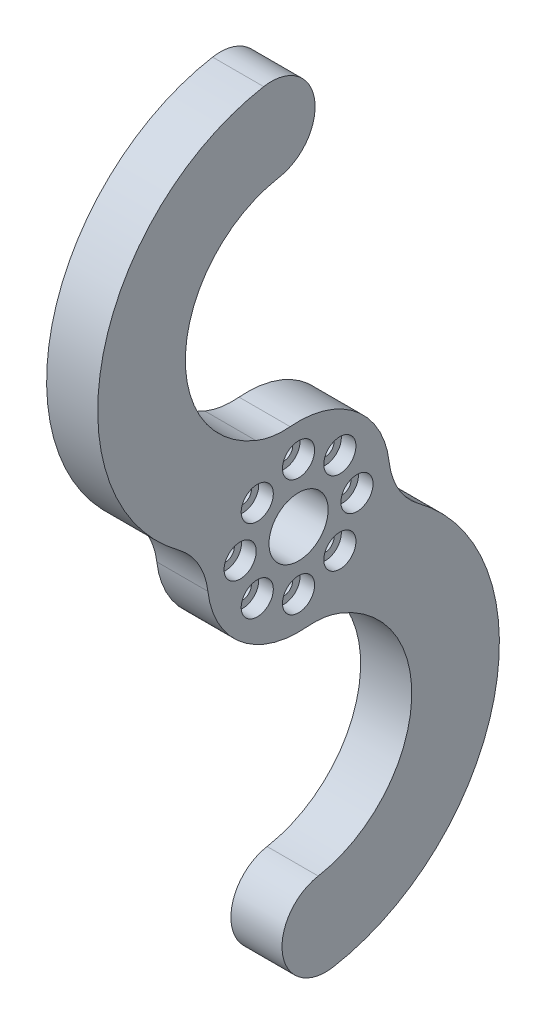
ISO-10303-21;
HEADER;
FILE_DESCRIPTION(('STEP AP214'),'2;1');
FILE_NAME('part.step','',(''),(''),'','','');
FILE_SCHEMA(('AUTOMOTIVE_DESIGN { 1 0 10303 214 1 1 1 1 }'));
ENDSEC;
DATA;
#1=APPLICATION_CONTEXT('core data for automotive mechanical design processes');
#2=APPLICATION_PROTOCOL_DEFINITION('international standard','automotive_design',2000,#1);
#3=PRODUCT_CONTEXT('',#1,'mechanical');
#4=PRODUCT('Part','Part','',(#3));
#5=PRODUCT_RELATED_PRODUCT_CATEGORY('part','',(#4));
#6=PRODUCT_DEFINITION_FORMATION('','',#4);
#7=PRODUCT_DEFINITION_CONTEXT('part definition',#1,'design');
#8=PRODUCT_DEFINITION('design','',#6,#7);
#9=PRODUCT_DEFINITION_SHAPE('','',#8);
#10=(LENGTH_UNIT() NAMED_UNIT(*) SI_UNIT(.MILLI.,.METRE.));
#11=(NAMED_UNIT(*) PLANE_ANGLE_UNIT() SI_UNIT($,.RADIAN.));
#12=(NAMED_UNIT(*) SI_UNIT($,.STERADIAN.) SOLID_ANGLE_UNIT());
#13=UNCERTAINTY_MEASURE_WITH_UNIT(LENGTH_MEASURE(1.E-05),#10,'distance_accuracy_value','');
#14=(GEOMETRIC_REPRESENTATION_CONTEXT(3) GLOBAL_UNCERTAINTY_ASSIGNED_CONTEXT((#13)) GLOBAL_UNIT_ASSIGNED_CONTEXT((#10,
#11,#12)) REPRESENTATION_CONTEXT('',''));
#15=CARTESIAN_POINT('',(0.,0.,0.));
#16=DIRECTION('',(0.,0.,1.));
#17=DIRECTION('',(1.,0.,0.));
#18=AXIS2_PLACEMENT_3D('',#15,#16,#17);
#19=CARTESIAN_POINT('',(7.,0.,0.));
#20=DIRECTION('',(-1.,0.,0.));
#21=DIRECTION('',(0.,0.,1.));
#22=AXIS2_PLACEMENT_3D('',#19,#20,#21);
#23=CYLINDRICAL_SURFACE('',#22,12.5);
#24=CARTESIAN_POINT('',(0.,0.,0.));
#25=DIRECTION('',(1.,0.,0.));
#26=DIRECTION('',(0.,0.,-1.));
#27=AXIS2_PLACEMENT_3D('',#24,#25,#26);
#28=CIRCLE('',#27,12.5);
#29=CARTESIAN_POINT('',(0.,1.45202020202021,-12.4153790652128));
#30=VERTEX_POINT('',#29);
#31=CARTESIAN_POINT('',(0.,12.4469696969697,1.150193619665));
#32=VERTEX_POINT('',#31);
#33=EDGE_CURVE('E185',#30,#32,#28,.T.);
#34=ORIENTED_EDGE('',*,*,#33,.T.);
#35=DIRECTION('',(-1.,0.,0.));
#36=VECTOR('',#35,1.);
#37=CARTESIAN_POINT('',(7.,12.4469696969697,1.150193619665));
#38=LINE('',#37,#36);
#39=CARTESIAN_POINT('',(7.,12.4469696969697,1.150193619665));
#40=VERTEX_POINT('',#39);
#41=EDGE_CURVE('E235',#32,#40,#38,.F.);
#42=ORIENTED_EDGE('',*,*,#41,.T.);
#43=CARTESIAN_POINT('',(7.,0.,0.));
#44=DIRECTION('',(1.,0.,0.));
#45=DIRECTION('',(0.,0.,-1.));
#46=AXIS2_PLACEMENT_3D('',#43,#44,#45);
#47=CIRCLE('',#46,12.5);
#48=CARTESIAN_POINT('',(7.,1.45202020202021,-12.4153790652128));
#49=VERTEX_POINT('',#48);
#50=EDGE_CURVE('E161',#49,#40,#47,.T.);
#51=ORIENTED_EDGE('',*,*,#50,.F.);
#52=DIRECTION('',(-1.,0.,0.));
#53=VECTOR('',#52,1.);
#54=CARTESIAN_POINT('',(7.,1.45202020202021,-12.4153790652128));
#55=LINE('',#54,#53);
#56=EDGE_CURVE('E231',#49,#30,#55,.T.);
#57=ORIENTED_EDGE('',*,*,#56,.T.);
#58=EDGE_LOOP('',(#34,#42,#51,#57));
#59=FACE_BOUND('',#58,.T.);
#60=ADVANCED_FACE('F41',(#59),#23,.T.);
#61=CARTESIAN_POINT('',(7.,27.5,0.));
#62=DIRECTION('',(-1.,0.,0.));
#63=DIRECTION('',(0.,0.,1.));
#64=AXIS2_PLACEMENT_3D('',#61,#62,#63);
#65=CYLINDRICAL_SURFACE('',#64,15.5);
#66=CARTESIAN_POINT('',(7.,27.5,0.));
#67=DIRECTION('',(1.,0.,0.));
#68=DIRECTION('',(0.,0.,-1.));
#69=AXIS2_PLACEMENT_3D('',#66,#67,#68);
#70=CIRCLE('',#69,15.5);
#71=CARTESIAN_POINT('',(7.,42.7645201716892,2.69154675383743));
#72=VERTEX_POINT('',#71);
#73=CARTESIAN_POINT('',(7.,13.1400826446281,5.83461854339158));
#74=VERTEX_POINT('',#73);
#75=EDGE_CURVE('E136',#72,#74,#70,.T.);
#76=ORIENTED_EDGE('',*,*,#75,.T.);
#77=DIRECTION('',(-1.,0.,0.));
#78=VECTOR('',#77,1.);
#79=CARTESIAN_POINT('',(7.,13.1400826446281,5.83461854339158));
#80=LINE('',#79,#78);
#81=CARTESIAN_POINT('',(0.,13.1400826446281,5.83461854339158));
#82=VERTEX_POINT('',#81);
#83=EDGE_CURVE('E228',#74,#82,#80,.T.);
#84=ORIENTED_EDGE('',*,*,#83,.T.);
#85=CARTESIAN_POINT('',(0.,27.5,0.));
#86=DIRECTION('',(1.,0.,0.));
#87=DIRECTION('',(0.,0.,-1.));
#88=AXIS2_PLACEMENT_3D('',#85,#86,#87);
#89=CIRCLE('',#88,15.5);
#90=CARTESIAN_POINT('',(0.,42.7645201716892,2.69154675383743));
#91=VERTEX_POINT('',#90);
#92=EDGE_CURVE('E139',#91,#82,#89,.T.);
#93=ORIENTED_EDGE('',*,*,#92,.F.);
#94=DIRECTION('',(-1.,0.,0.));
#95=VECTOR('',#94,1.);
#96=CARTESIAN_POINT('',(7.,42.7645201716892,2.69154675383743));
#97=LINE('',#96,#95);
#98=EDGE_CURVE('E131',#72,#91,#97,.T.);
#99=ORIENTED_EDGE('',*,*,#98,.F.);
#100=EDGE_LOOP('',(#76,#84,#93,#99));
#101=FACE_BOUND('',#100,.T.);
#102=ADVANCED_FACE('F133',(#101),#65,.F.);
#103=CARTESIAN_POINT('',(7.,48.6733666897625,3.73343581983902));
#104=DIRECTION('',(-1.,0.,0.));
#105=DIRECTION('',(0.,0.,1.));
#106=AXIS2_PLACEMENT_3D('',#103,#104,#105);
#107=CYLINDRICAL_SURFACE('',#106,6.00000000000001);
#108=CARTESIAN_POINT('',(0.,48.6733666897625,3.73343581983902));
#109=DIRECTION('',(1.,0.,0.));
#110=DIRECTION('',(0.,0.,-1.));
#111=AXIS2_PLACEMENT_3D('',#108,#109,#110);
#112=CIRCLE('',#111,6.00000000000001);
#113=CARTESIAN_POINT('',(0.,54.5822132078357,4.77532488584061));
#114=VERTEX_POINT('',#113);
#115=EDGE_CURVE('E193',#91,#114,#112,.T.);
#116=ORIENTED_EDGE('',*,*,#115,.T.);
#117=DIRECTION('',(-1.,0.,0.));
#118=VECTOR('',#117,1.);
#119=CARTESIAN_POINT('',(7.,54.5822132078357,4.77532488584061));
#120=LINE('',#119,#118);
#121=CARTESIAN_POINT('',(7.,54.5822132078357,4.77532488584061));
#122=VERTEX_POINT('',#121);
#123=EDGE_CURVE('E144',#122,#114,#120,.T.);
#124=ORIENTED_EDGE('',*,*,#123,.F.);
#125=CARTESIAN_POINT('',(7.,48.6733666897625,3.73343581983902));
#126=DIRECTION('',(1.,0.,0.));
#127=DIRECTION('',(0.,0.,-1.));
#128=AXIS2_PLACEMENT_3D('',#125,#126,#127);
#129=CIRCLE('',#128,6.00000000000001);
#130=EDGE_CURVE('E147',#72,#122,#129,.T.);
#131=ORIENTED_EDGE('',*,*,#130,.F.);
#132=ORIENTED_EDGE('',*,*,#98,.T.);
#133=EDGE_LOOP('',(#116,#124,#131,#132));
#134=FACE_BOUND('',#133,.T.);
#135=ADVANCED_FACE('F148',(#134),#107,.T.);
#136=CARTESIAN_POINT('',(7.,27.5,0.));
#137=DIRECTION('',(-1.,0.,0.));
#138=DIRECTION('',(0.,0.,1.));
#139=AXIS2_PLACEMENT_3D('',#136,#137,#138);
#140=CYLINDRICAL_SURFACE('',#139,27.5);
#141=CARTESIAN_POINT('',(0.,27.5,0.));
#142=DIRECTION('',(1.,0.,0.));
#143=DIRECTION('',(0.,0.,-1.));
#144=AXIS2_PLACEMENT_3D('',#141,#142,#143);
#145=CIRCLE('',#144,27.5);
#146=CARTESIAN_POINT('',(0.,5.41666666666666,16.3883003660809));
#147=VERTEX_POINT('',#146);
#148=EDGE_CURVE('E196',#114,#147,#145,.T.);
#149=ORIENTED_EDGE('',*,*,#148,.T.);
#150=DIRECTION('',(-1.,0.,0.));
#151=VECTOR('',#150,1.);
#152=CARTESIAN_POINT('',(7.,5.41666666666666,16.3883003660809));
#153=LINE('',#152,#151);
#154=CARTESIAN_POINT('',(7.,5.41666666666666,16.3883003660809));
#155=VERTEX_POINT('',#154);
#156=EDGE_CURVE('E225',#147,#155,#153,.F.);
#157=ORIENTED_EDGE('',*,*,#156,.T.);
#158=CARTESIAN_POINT('',(7.,27.5,0.));
#159=DIRECTION('',(1.,0.,0.));
#160=DIRECTION('',(0.,0.,-1.));
#161=AXIS2_PLACEMENT_3D('',#158,#159,#160);
#162=CIRCLE('',#161,27.5);
#163=EDGE_CURVE('E153',#122,#155,#162,.T.);
#164=ORIENTED_EDGE('',*,*,#163,.F.);
#165=ORIENTED_EDGE('',*,*,#123,.T.);
#166=EDGE_LOOP('',(#149,#157,#164,#165));
#167=FACE_BOUND('',#166,.T.);
#168=ADVANCED_FACE('F295',(#167),#140,.T.);
#169=CARTESIAN_POINT('',(7.,-1.45202020202021,12.4153790652128));
#170=VERTEX_POINT('',#169);
#171=CARTESIAN_POINT('',(7.,-12.4469696969697,-1.150193619665));
#172=VERTEX_POINT('',#171);
#173=EDGE_CURVE('E166',#170,#172,#47,.T.);
#174=ORIENTED_EDGE('',*,*,#173,.F.);
#175=DIRECTION('',(-1.,0.,0.));
#176=VECTOR('',#175,1.);
#177=CARTESIAN_POINT('',(7.,-1.45202020202021,12.4153790652128));
#178=LINE('',#177,#176);
#179=CARTESIAN_POINT('',(0.,-1.45202020202021,12.4153790652128));
#180=VERTEX_POINT('',#179);
#181=EDGE_CURVE('E221',#170,#180,#178,.T.);
#182=ORIENTED_EDGE('',*,*,#181,.T.);
#183=CARTESIAN_POINT('',(0.,-12.4469696969697,-1.150193619665));
#184=VERTEX_POINT('',#183);
#185=EDGE_CURVE('E190',#180,#184,#28,.T.);
#186=ORIENTED_EDGE('',*,*,#185,.T.);
#187=DIRECTION('',(-1.,0.,0.));
#188=VECTOR('',#187,1.);
#189=CARTESIAN_POINT('',(7.,-12.4469696969697,-1.150193619665));
#190=LINE('',#189,#188);
#191=EDGE_CURVE('E143',#184,#172,#190,.F.);
#192=ORIENTED_EDGE('',*,*,#191,.T.);
#193=EDGE_LOOP('',(#174,#182,#186,#192));
#194=FACE_BOUND('',#193,.T.);
#195=ADVANCED_FACE('F270',(#194),#23,.T.);
#196=CARTESIAN_POINT('',(7.,-27.5,0.));
#197=DIRECTION('',(-1.,0.,0.));
#198=DIRECTION('',(0.,0.,1.));
#199=AXIS2_PLACEMENT_3D('',#196,#197,#198);
#200=CYLINDRICAL_SURFACE('',#199,15.5);
#201=CARTESIAN_POINT('',(7.,-27.5,0.));
#202=DIRECTION('',(1.,0.,0.));
#203=DIRECTION('',(0.,0.,-1.));
#204=AXIS2_PLACEMENT_3D('',#201,#202,#203);
#205=CIRCLE('',#204,15.5);
#206=CARTESIAN_POINT('',(7.,-42.7645201716892,-2.69154675383743));
#207=VERTEX_POINT('',#206);
#208=CARTESIAN_POINT('',(7.,-13.1400826446281,-5.83461854339157));
#209=VERTEX_POINT('',#208);
#210=EDGE_CURVE('E171',#207,#209,#205,.T.);
#211=ORIENTED_EDGE('',*,*,#210,.T.);
#212=DIRECTION('',(-1.,0.,0.));
#213=VECTOR('',#212,1.);
#214=CARTESIAN_POINT('',(7.,-13.1400826446281,-5.83461854339157));
#215=LINE('',#214,#213);
#216=CARTESIAN_POINT('',(0.,-13.1400826446281,-5.83461854339157));
#217=VERTEX_POINT('',#216);
#218=EDGE_CURVE('E241',#209,#217,#215,.T.);
#219=ORIENTED_EDGE('',*,*,#218,.T.);
#220=CARTESIAN_POINT('',(0.,-27.5,0.));
#221=DIRECTION('',(1.,0.,0.));
#222=DIRECTION('',(0.,0.,-1.));
#223=AXIS2_PLACEMENT_3D('',#220,#221,#222);
#224=CIRCLE('',#223,15.5);
#225=CARTESIAN_POINT('',(0.,-42.7645201716892,-2.69154675383743));
#226=VERTEX_POINT('',#225);
#227=EDGE_CURVE('E200',#226,#217,#224,.T.);
#228=ORIENTED_EDGE('',*,*,#227,.F.);
#229=DIRECTION('',(-1.,0.,0.));
#230=VECTOR('',#229,1.);
#231=CARTESIAN_POINT('',(7.,-42.7645201716892,-2.69154675383743));
#232=LINE('',#231,#230);
#233=EDGE_CURVE('E214',#207,#226,#232,.T.);
#234=ORIENTED_EDGE('',*,*,#233,.F.);
#235=EDGE_LOOP('',(#211,#219,#228,#234));
#236=FACE_BOUND('',#235,.T.);
#237=ADVANCED_FACE('F274',(#236),#200,.F.);
#238=CARTESIAN_POINT('',(7.,-48.6733666897625,-3.73343581983902));
#239=DIRECTION('',(-1.,0.,0.));
#240=DIRECTION('',(0.,0.,1.));
#241=AXIS2_PLACEMENT_3D('',#238,#239,#240);
#242=CYLINDRICAL_SURFACE('',#241,6.00000000000001);
#243=CARTESIAN_POINT('',(0.,-48.6733666897625,-3.73343581983902));
#244=DIRECTION('',(1.,0.,0.));
#245=DIRECTION('',(0.,0.,-1.));
#246=AXIS2_PLACEMENT_3D('',#243,#244,#245);
#247=CIRCLE('',#246,6.00000000000001);
#248=CARTESIAN_POINT('',(0.,-54.5822132078357,-4.77532488584061));
#249=VERTEX_POINT('',#248);
#250=EDGE_CURVE('E204',#226,#249,#247,.T.);
#251=ORIENTED_EDGE('',*,*,#250,.T.);
#252=DIRECTION('',(-1.,0.,0.));
#253=VECTOR('',#252,1.);
#254=CARTESIAN_POINT('',(7.,-54.5822132078357,-4.77532488584061));
#255=LINE('',#254,#253);
#256=CARTESIAN_POINT('',(7.,-54.5822132078357,-4.77532488584061));
#257=VERTEX_POINT('',#256);
#258=EDGE_CURVE('E180',#257,#249,#255,.T.);
#259=ORIENTED_EDGE('',*,*,#258,.F.);
#260=CARTESIAN_POINT('',(7.,-48.6733666897625,-3.73343581983902));
#261=DIRECTION('',(1.,0.,0.));
#262=DIRECTION('',(0.,0.,-1.));
#263=AXIS2_PLACEMENT_3D('',#260,#261,#262);
#264=CIRCLE('',#263,6.00000000000001);
#265=EDGE_CURVE('E174',#207,#257,#264,.T.);
#266=ORIENTED_EDGE('',*,*,#265,.F.);
#267=ORIENTED_EDGE('',*,*,#233,.T.);
#268=EDGE_LOOP('',(#251,#259,#266,#267));
#269=FACE_BOUND('',#268,.T.);
#270=ADVANCED_FACE('F280',(#269),#242,.T.);
#271=CARTESIAN_POINT('',(7.,0.,0.));
#272=DIRECTION('',(-1.,0.,0.));
#273=DIRECTION('',(0.,0.,1.));
#274=AXIS2_PLACEMENT_3D('',#271,#272,#273);
#275=CYLINDRICAL_SURFACE('',#274,4.05);
#276=CARTESIAN_POINT('',(7.,0.,0.));
#277=DIRECTION('',(1.,0.,0.));
#278=DIRECTION('',(0.,0.,-1.));
#279=AXIS2_PLACEMENT_3D('',#276,#277,#278);
#280=CIRCLE('',#279,4.05);
#281=CARTESIAN_POINT('',(7.,0.,-4.05));
#282=VERTEX_POINT('',#281);
#283=EDGE_CURVE('E164',#282,#282,#280,.T.);
#284=ORIENTED_EDGE('',*,*,#283,.T.);
#285=EDGE_LOOP('',(#284));
#286=FACE_BOUND('',#285,.T.);
#287=CARTESIAN_POINT('',(0.,0.,0.));
#288=DIRECTION('',(1.,0.,0.));
#289=DIRECTION('',(0.,0.,-1.));
#290=AXIS2_PLACEMENT_3D('',#287,#288,#289);
#291=CIRCLE('',#290,4.05);
#292=CARTESIAN_POINT('',(0.,0.,-4.05));
#293=VERTEX_POINT('',#292);
#294=EDGE_CURVE('E181',#293,#293,#291,.T.);
#295=ORIENTED_EDGE('',*,*,#294,.F.);
#296=EDGE_LOOP('',(#295));
#297=FACE_BOUND('',#296,.T.);
#298=ADVANCED_FACE('F327',(#286,#297),#275,.F.);
#299=CARTESIAN_POINT('',(7.,-27.5,0.));
#300=DIRECTION('',(-1.,0.,0.));
#301=DIRECTION('',(0.,0.,1.));
#302=AXIS2_PLACEMENT_3D('',#299,#300,#301);
#303=CYLINDRICAL_SURFACE('',#302,27.5);
#304=CARTESIAN_POINT('',(0.,-27.5,0.));
#305=DIRECTION('',(1.,0.,0.));
#306=DIRECTION('',(0.,0.,-1.));
#307=AXIS2_PLACEMENT_3D('',#304,#305,#306);
#308=CIRCLE('',#307,27.5);
#309=CARTESIAN_POINT('',(0.,-5.41666666666666,-16.3883003660809));
#310=VERTEX_POINT('',#309);
#311=EDGE_CURVE('E207',#249,#310,#308,.T.);
#312=ORIENTED_EDGE('',*,*,#311,.T.);
#313=DIRECTION('',(-1.,0.,0.));
#314=VECTOR('',#313,1.);
#315=CARTESIAN_POINT('',(7.,-5.41666666666666,-16.3883003660809));
#316=LINE('',#315,#314);
#317=CARTESIAN_POINT('',(7.,-5.41666666666666,-16.3883003660809));
#318=VERTEX_POINT('',#317);
#319=EDGE_CURVE('E238',#310,#318,#316,.F.);
#320=ORIENTED_EDGE('',*,*,#319,.T.);
#321=CARTESIAN_POINT('',(7.,-27.5,0.));
#322=DIRECTION('',(1.,0.,0.));
#323=DIRECTION('',(0.,0.,-1.));
#324=AXIS2_PLACEMENT_3D('',#321,#322,#323);
#325=CIRCLE('',#324,27.5);
#326=EDGE_CURVE('E177',#257,#318,#325,.T.);
#327=ORIENTED_EDGE('',*,*,#326,.F.);
#328=ORIENTED_EDGE('',*,*,#258,.T.);
#329=EDGE_LOOP('',(#312,#320,#327,#328));
#330=FACE_BOUND('',#329,.T.);
#331=ADVANCED_FACE('F283',(#330),#303,.T.);
#332=CARTESIAN_POINT('',(7.,0.,0.));
#333=DIRECTION('',(1.,0.,0.));
#334=DIRECTION('',(0.,0.,-1.));
#335=AXIS2_PLACEMENT_3D('',#332,#333,#334);
#336=PLANE('',#335);
#337=CARTESIAN_POINT('',(7.,8.,0.));
#338=DIRECTION('',(1.,0.,0.));
#339=DIRECTION('',(0.,0.,-1.));
#340=AXIS2_PLACEMENT_3D('',#337,#338,#339);
#341=CIRCLE('',#340,2.2);
#342=CARTESIAN_POINT('',(7.,8.,-2.2));
#343=VERTEX_POINT('',#342);
#344=EDGE_CURVE('E467',#343,#343,#341,.T.);
#345=ORIENTED_EDGE('',*,*,#344,.F.);
#346=EDGE_LOOP('',(#345));
#347=FACE_BOUND('',#346,.T.);
#348=CARTESIAN_POINT('',(7.,5.65685424949238,-5.65685424949238));
#349=DIRECTION('',(1.,0.,0.));
#350=DIRECTION('',(0.,0.,-1.));
#351=AXIS2_PLACEMENT_3D('',#348,#349,#350);
#352=CIRCLE('',#351,2.2);
#353=CARTESIAN_POINT('',(7.,5.65685424949238,-7.85685424949238));
#354=VERTEX_POINT('',#353);
#355=EDGE_CURVE('E451',#354,#354,#352,.T.);
#356=ORIENTED_EDGE('',*,*,#355,.F.);
#357=EDGE_LOOP('',(#356));
#358=FACE_BOUND('',#357,.T.);
#359=CARTESIAN_POINT('',(7.,0.,-8.));
#360=DIRECTION('',(1.,0.,0.));
#361=DIRECTION('',(0.,0.,-1.));
#362=AXIS2_PLACEMENT_3D('',#359,#360,#361);
#363=CIRCLE('',#362,2.2);
#364=CARTESIAN_POINT('',(7.,0.,-10.2));
#365=VERTEX_POINT('',#364);
#366=EDGE_CURVE('E435',#365,#365,#363,.T.);
#367=ORIENTED_EDGE('',*,*,#366,.F.);
#368=EDGE_LOOP('',(#367));
#369=FACE_BOUND('',#368,.T.);
#370=CARTESIAN_POINT('',(7.,-5.65685424949238,-5.65685424949238));
#371=DIRECTION('',(1.,0.,0.));
#372=DIRECTION('',(0.,0.,-1.));
#373=AXIS2_PLACEMENT_3D('',#370,#371,#372);
#374=CIRCLE('',#373,2.2);
#375=CARTESIAN_POINT('',(7.,-5.65685424949238,-7.85685424949238));
#376=VERTEX_POINT('',#375);
#377=EDGE_CURVE('E419',#376,#376,#374,.T.);
#378=ORIENTED_EDGE('',*,*,#377,.F.);
#379=EDGE_LOOP('',(#378));
#380=FACE_BOUND('',#379,.T.);
#381=CARTESIAN_POINT('',(7.,-8.,0.));
#382=DIRECTION('',(1.,0.,0.));
#383=DIRECTION('',(0.,0.,-1.));
#384=AXIS2_PLACEMENT_3D('',#381,#382,#383);
#385=CIRCLE('',#384,2.2);
#386=CARTESIAN_POINT('',(7.,-8.,-2.2));
#387=VERTEX_POINT('',#386);
#388=EDGE_CURVE('E403',#387,#387,#385,.T.);
#389=ORIENTED_EDGE('',*,*,#388,.F.);
#390=EDGE_LOOP('',(#389));
#391=FACE_BOUND('',#390,.T.);
#392=CARTESIAN_POINT('',(7.,-5.65685424949238,5.65685424949238));
#393=DIRECTION('',(1.,0.,0.));
#394=DIRECTION('',(0.,0.,-1.));
#395=AXIS2_PLACEMENT_3D('',#392,#393,#394);
#396=CIRCLE('',#395,2.2);
#397=CARTESIAN_POINT('',(7.,-5.65685424949238,3.45685424949238));
#398=VERTEX_POINT('',#397);
#399=EDGE_CURVE('E387',#398,#398,#396,.T.);
#400=ORIENTED_EDGE('',*,*,#399,.F.);
#401=EDGE_LOOP('',(#400));
#402=FACE_BOUND('',#401,.T.);
#403=CARTESIAN_POINT('',(7.,0.,8.));
#404=DIRECTION('',(1.,0.,0.));
#405=DIRECTION('',(0.,0.,-1.));
#406=AXIS2_PLACEMENT_3D('',#403,#404,#405);
#407=CIRCLE('',#406,2.2);
#408=CARTESIAN_POINT('',(7.,0.,5.8));
#409=VERTEX_POINT('',#408);
#410=EDGE_CURVE('E371',#409,#409,#407,.T.);
#411=ORIENTED_EDGE('',*,*,#410,.F.);
#412=EDGE_LOOP('',(#411));
#413=FACE_BOUND('',#412,.T.);
#414=CARTESIAN_POINT('',(7.,5.65685424949238,5.65685424949238));
#415=DIRECTION('',(1.,0.,0.));
#416=DIRECTION('',(0.,0.,-1.));
#417=AXIS2_PLACEMENT_3D('',#414,#415,#416);
#418=CIRCLE('',#417,2.2);
#419=CARTESIAN_POINT('',(7.,5.65685424949238,3.45685424949238));
#420=VERTEX_POINT('',#419);
#421=EDGE_CURVE('E355',#420,#420,#418,.T.);
#422=ORIENTED_EDGE('',*,*,#421,.F.);
#423=EDGE_LOOP('',(#422));
#424=FACE_BOUND('',#423,.T.);
#425=ORIENTED_EDGE('',*,*,#283,.F.);
#426=EDGE_LOOP('',(#425));
#427=FACE_BOUND('',#426,.T.);
#428=ORIENTED_EDGE('',*,*,#326,.T.);
#429=CARTESIAN_POINT('',(7.,2.61363636363637,-22.3476823173831));
#430=DIRECTION('',(1.,0.,0.));
#431=DIRECTION('',(0.,0.,-1.));
#432=AXIS2_PLACEMENT_3D('',#429,#430,#431);
#433=CIRCLE('',#432,10.);
#434=EDGE_CURVE('E258',#318,#49,#433,.F.);
#435=ORIENTED_EDGE('',*,*,#434,.T.);
#436=ORIENTED_EDGE('',*,*,#50,.T.);
#437=CARTESIAN_POINT('',(7.,22.4045454545455,2.07034851539701));
#438=DIRECTION('',(1.,0.,0.));
#439=DIRECTION('',(0.,0.,-1.));
#440=AXIS2_PLACEMENT_3D('',#437,#438,#439);
#441=CIRCLE('',#440,10.);
#442=EDGE_CURVE('E159',#40,#74,#441,.F.);
#443=ORIENTED_EDGE('',*,*,#442,.T.);
#444=ORIENTED_EDGE('',*,*,#75,.F.);
#445=ORIENTED_EDGE('',*,*,#130,.T.);
#446=ORIENTED_EDGE('',*,*,#163,.T.);
#447=CARTESIAN_POINT('',(7.,-2.61363636363637,22.3476823173831));
#448=DIRECTION('',(1.,0.,0.));
#449=DIRECTION('',(0.,0.,-1.));
#450=AXIS2_PLACEMENT_3D('',#447,#448,#449);
#451=CIRCLE('',#450,10.);
#452=EDGE_CURVE('E247',#155,#170,#451,.F.);
#453=ORIENTED_EDGE('',*,*,#452,.T.);
#454=ORIENTED_EDGE('',*,*,#173,.T.);
#455=CARTESIAN_POINT('',(7.,-22.4045454545455,-2.07034851539701));
#456=DIRECTION('',(1.,0.,0.));
#457=DIRECTION('',(0.,0.,-1.));
#458=AXIS2_PLACEMENT_3D('',#455,#456,#457);
#459=CIRCLE('',#458,10.);
#460=EDGE_CURVE('E11',#172,#209,#459,.F.);
#461=ORIENTED_EDGE('',*,*,#460,.T.);
#462=ORIENTED_EDGE('',*,*,#210,.F.);
#463=ORIENTED_EDGE('',*,*,#265,.T.);
#464=EDGE_LOOP('',(#428,#435,#436,#443,#444,#445,#446,#453,#454,#461,#462,#463));
#465=FACE_BOUND('',#464,.T.);
#466=ADVANCED_FACE('F156',(#347,#358,#369,#380,#391,#402,#413,#424,#427,#465),#336,.T.);
#467=CARTESIAN_POINT('',(0.,0.,0.));
#468=DIRECTION('',(1.,0.,0.));
#469=DIRECTION('',(0.,0.,-1.));
#470=AXIS2_PLACEMENT_3D('',#467,#468,#469);
#471=PLANE('',#470);
#472=CARTESIAN_POINT('',(0.,8.,0.));
#473=DIRECTION('',(1.,0.,0.));
#474=DIRECTION('',(0.,0.,-1.));
#475=AXIS2_PLACEMENT_3D('',#472,#473,#474);
#476=CIRCLE('',#475,1.2);
#477=CARTESIAN_POINT('',(0.,8.,-1.2));
#478=VERTEX_POINT('',#477);
#479=EDGE_CURVE('E455',#478,#478,#476,.T.);
#480=ORIENTED_EDGE('',*,*,#479,.T.);
#481=EDGE_LOOP('',(#480));
#482=FACE_BOUND('',#481,.T.);
#483=CARTESIAN_POINT('',(0.,5.65685424949238,-5.65685424949238));
#484=DIRECTION('',(1.,0.,0.));
#485=DIRECTION('',(0.,0.,-1.));
#486=AXIS2_PLACEMENT_3D('',#483,#484,#485);
#487=CIRCLE('',#486,1.2);
#488=CARTESIAN_POINT('',(0.,5.65685424949238,-6.85685424949238));
#489=VERTEX_POINT('',#488);
#490=EDGE_CURVE('E439',#489,#489,#487,.T.);
#491=ORIENTED_EDGE('',*,*,#490,.T.);
#492=EDGE_LOOP('',(#491));
#493=FACE_BOUND('',#492,.T.);
#494=CARTESIAN_POINT('',(0.,0.,-8.));
#495=DIRECTION('',(1.,0.,0.));
#496=DIRECTION('',(0.,0.,-1.));
#497=AXIS2_PLACEMENT_3D('',#494,#495,#496);
#498=CIRCLE('',#497,1.2);
#499=CARTESIAN_POINT('',(0.,0.,-9.2));
#500=VERTEX_POINT('',#499);
#501=EDGE_CURVE('E423',#500,#500,#498,.T.);
#502=ORIENTED_EDGE('',*,*,#501,.T.);
#503=EDGE_LOOP('',(#502));
#504=FACE_BOUND('',#503,.T.);
#505=CARTESIAN_POINT('',(0.,-5.65685424949238,-5.65685424949238));
#506=DIRECTION('',(1.,0.,0.));
#507=DIRECTION('',(0.,0.,-1.));
#508=AXIS2_PLACEMENT_3D('',#505,#506,#507);
#509=CIRCLE('',#508,1.2);
#510=CARTESIAN_POINT('',(0.,-5.65685424949238,-6.85685424949238));
#511=VERTEX_POINT('',#510);
#512=EDGE_CURVE('E407',#511,#511,#509,.T.);
#513=ORIENTED_EDGE('',*,*,#512,.T.);
#514=EDGE_LOOP('',(#513));
#515=FACE_BOUND('',#514,.T.);
#516=CARTESIAN_POINT('',(0.,-8.,0.));
#517=DIRECTION('',(1.,0.,0.));
#518=DIRECTION('',(0.,0.,-1.));
#519=AXIS2_PLACEMENT_3D('',#516,#517,#518);
#520=CIRCLE('',#519,1.2);
#521=CARTESIAN_POINT('',(0.,-8.,-1.2));
#522=VERTEX_POINT('',#521);
#523=EDGE_CURVE('E391',#522,#522,#520,.T.);
#524=ORIENTED_EDGE('',*,*,#523,.T.);
#525=EDGE_LOOP('',(#524));
#526=FACE_BOUND('',#525,.T.);
#527=CARTESIAN_POINT('',(0.,-5.65685424949238,5.65685424949238));
#528=DIRECTION('',(1.,0.,0.));
#529=DIRECTION('',(0.,0.,-1.));
#530=AXIS2_PLACEMENT_3D('',#527,#528,#529);
#531=CIRCLE('',#530,1.2);
#532=CARTESIAN_POINT('',(0.,-5.65685424949238,4.45685424949238));
#533=VERTEX_POINT('',#532);
#534=EDGE_CURVE('E375',#533,#533,#531,.T.);
#535=ORIENTED_EDGE('',*,*,#534,.T.);
#536=EDGE_LOOP('',(#535));
#537=FACE_BOUND('',#536,.T.);
#538=CARTESIAN_POINT('',(0.,0.,8.));
#539=DIRECTION('',(1.,0.,0.));
#540=DIRECTION('',(0.,0.,-1.));
#541=AXIS2_PLACEMENT_3D('',#538,#539,#540);
#542=CIRCLE('',#541,1.2);
#543=CARTESIAN_POINT('',(0.,0.,6.8));
#544=VERTEX_POINT('',#543);
#545=EDGE_CURVE('E359',#544,#544,#542,.T.);
#546=ORIENTED_EDGE('',*,*,#545,.T.);
#547=EDGE_LOOP('',(#546));
#548=FACE_BOUND('',#547,.T.);
#549=CARTESIAN_POINT('',(0.,5.65685424949238,5.65685424949238));
#550=DIRECTION('',(1.,0.,0.));
#551=DIRECTION('',(0.,0.,-1.));
#552=AXIS2_PLACEMENT_3D('',#549,#550,#551);
#553=CIRCLE('',#552,1.2);
#554=CARTESIAN_POINT('',(0.,5.65685424949238,4.45685424949238));
#555=VERTEX_POINT('',#554);
#556=EDGE_CURVE('E186',#555,#555,#553,.T.);
#557=ORIENTED_EDGE('',*,*,#556,.T.);
#558=EDGE_LOOP('',(#557));
#559=FACE_BOUND('',#558,.T.);
#560=ORIENTED_EDGE('',*,*,#294,.T.);
#561=EDGE_LOOP('',(#560));
#562=FACE_BOUND('',#561,.T.);
#563=ORIENTED_EDGE('',*,*,#33,.F.);
#564=CARTESIAN_POINT('',(0.,2.61363636363637,-22.3476823173831));
#565=DIRECTION('',(1.,0.,0.));
#566=DIRECTION('',(0.,0.,-1.));
#567=AXIS2_PLACEMENT_3D('',#564,#565,#566);
#568=CIRCLE('',#567,10.);
#569=EDGE_CURVE('E255',#30,#310,#568,.T.);
#570=ORIENTED_EDGE('',*,*,#569,.T.);
#571=ORIENTED_EDGE('',*,*,#311,.F.);
#572=ORIENTED_EDGE('',*,*,#250,.F.);
#573=ORIENTED_EDGE('',*,*,#227,.T.);
#574=CARTESIAN_POINT('',(0.,-22.4045454545455,-2.07034851539701));
#575=DIRECTION('',(1.,0.,0.));
#576=DIRECTION('',(0.,0.,-1.));
#577=AXIS2_PLACEMENT_3D('',#574,#575,#576);
#578=CIRCLE('',#577,10.);
#579=EDGE_CURVE('E50',#217,#184,#578,.T.);
#580=ORIENTED_EDGE('',*,*,#579,.T.);
#581=ORIENTED_EDGE('',*,*,#185,.F.);
#582=CARTESIAN_POINT('',(0.,-2.61363636363637,22.3476823173831));
#583=DIRECTION('',(1.,0.,0.));
#584=DIRECTION('',(0.,0.,-1.));
#585=AXIS2_PLACEMENT_3D('',#582,#583,#584);
#586=CIRCLE('',#585,10.);
#587=EDGE_CURVE('E244',#180,#147,#586,.T.);
#588=ORIENTED_EDGE('',*,*,#587,.T.);
#589=ORIENTED_EDGE('',*,*,#148,.F.);
#590=ORIENTED_EDGE('',*,*,#115,.F.);
#591=ORIENTED_EDGE('',*,*,#92,.T.);
#592=CARTESIAN_POINT('',(0.,22.4045454545455,2.07034851539701));
#593=DIRECTION('',(1.,0.,0.));
#594=DIRECTION('',(0.,0.,-1.));
#595=AXIS2_PLACEMENT_3D('',#592,#593,#594);
#596=CIRCLE('',#595,10.);
#597=EDGE_CURVE('E250',#82,#32,#596,.T.);
#598=ORIENTED_EDGE('',*,*,#597,.T.);
#599=EDGE_LOOP('',(#563,#570,#571,#572,#573,#580,#581,#588,#589,#590,#591,#598));
#600=FACE_BOUND('',#599,.T.);
#601=ADVANCED_FACE('F265',(#482,#493,#504,#515,#526,#537,#548,#559,#562,#600),#471,.F.);
#602=CARTESIAN_POINT('',(7.,-2.61363636363637,22.3476823173831));
#603=DIRECTION('',(1.,0.,0.));
#604=DIRECTION('',(0.,0.,-1.));
#605=AXIS2_PLACEMENT_3D('',#602,#603,#604);
#606=CYLINDRICAL_SURFACE('',#605,10.);
#607=ORIENTED_EDGE('',*,*,#452,.F.);
#608=ORIENTED_EDGE('',*,*,#156,.F.);
#609=ORIENTED_EDGE('',*,*,#587,.F.);
#610=ORIENTED_EDGE('',*,*,#181,.F.);
#611=EDGE_LOOP('',(#607,#608,#609,#610));
#612=FACE_BOUND('',#611,.T.);
#613=ADVANCED_FACE('F299',(#612),#606,.F.);
#614=CARTESIAN_POINT('',(7.,22.4045454545455,2.07034851539701));
#615=DIRECTION('',(-1.,0.,0.));
#616=DIRECTION('',(0.,0.,1.));
#617=AXIS2_PLACEMENT_3D('',#614,#615,#616);
#618=CYLINDRICAL_SURFACE('',#617,10.);
#619=ORIENTED_EDGE('',*,*,#442,.F.);
#620=ORIENTED_EDGE('',*,*,#41,.F.);
#621=ORIENTED_EDGE('',*,*,#597,.F.);
#622=ORIENTED_EDGE('',*,*,#83,.F.);
#623=EDGE_LOOP('',(#619,#620,#621,#622));
#624=FACE_BOUND('',#623,.T.);
#625=ADVANCED_FACE('F292',(#624),#618,.F.);
#626=CARTESIAN_POINT('',(7.,2.61363636363637,-22.3476823173831));
#627=DIRECTION('',(1.,0.,0.));
#628=DIRECTION('',(0.,0.,-1.));
#629=AXIS2_PLACEMENT_3D('',#626,#627,#628);
#630=CYLINDRICAL_SURFACE('',#629,10.);
#631=ORIENTED_EDGE('',*,*,#434,.F.);
#632=ORIENTED_EDGE('',*,*,#319,.F.);
#633=ORIENTED_EDGE('',*,*,#569,.F.);
#634=ORIENTED_EDGE('',*,*,#56,.F.);
#635=EDGE_LOOP('',(#631,#632,#633,#634));
#636=FACE_BOUND('',#635,.T.);
#637=ADVANCED_FACE('F286',(#636),#630,.F.);
#638=CARTESIAN_POINT('',(7.,-22.4045454545455,-2.07034851539701));
#639=DIRECTION('',(-1.,0.,0.));
#640=DIRECTION('',(0.,0.,1.));
#641=AXIS2_PLACEMENT_3D('',#638,#639,#640);
#642=CYLINDRICAL_SURFACE('',#641,10.);
#643=ORIENTED_EDGE('',*,*,#460,.F.);
#644=ORIENTED_EDGE('',*,*,#191,.F.);
#645=ORIENTED_EDGE('',*,*,#579,.F.);
#646=ORIENTED_EDGE('',*,*,#218,.F.);
#647=EDGE_LOOP('',(#643,#644,#645,#646));
#648=FACE_BOUND('',#647,.T.);
#649=ADVANCED_FACE('F43',(#648),#642,.F.);
#650=CARTESIAN_POINT('',(7.,5.65685424949238,5.65685424949238));
#651=DIRECTION('',(1.,0.,0.));
#652=DIRECTION('',(0.,0.,-1.));
#653=AXIS2_PLACEMENT_3D('',#650,#651,#652);
#654=CYLINDRICAL_SURFACE('',#653,1.2);
#655=ORIENTED_EDGE('',*,*,#556,.F.);
#656=EDGE_LOOP('',(#655));
#657=FACE_BOUND('',#656,.T.);
#658=CARTESIAN_POINT('',(5.,5.65685424949238,5.65685424949238));
#659=DIRECTION('',(1.,0.,0.));
#660=DIRECTION('',(0.,0.,-1.));
#661=AXIS2_PLACEMENT_3D('',#658,#659,#660);
#662=CIRCLE('',#661,1.2);
#663=CARTESIAN_POINT('',(5.,5.65685424949238,4.45685424949238));
#664=VERTEX_POINT('',#663);
#665=EDGE_CURVE('E347',#664,#664,#662,.T.);
#666=ORIENTED_EDGE('',*,*,#665,.T.);
#667=EDGE_LOOP('',(#666));
#668=FACE_BOUND('',#667,.T.);
#669=ADVANCED_FACE('F504',(#657,#668),#654,.F.);
#670=CARTESIAN_POINT('',(5.,6.85685424949238,5.65685424949238));
#671=DIRECTION('',(-1.,0.,0.));
#672=DIRECTION('',(0.,0.,1.));
#673=AXIS2_PLACEMENT_3D('',#670,#671,#672);
#674=PLANE('',#673);
#675=ORIENTED_EDGE('',*,*,#665,.F.);
#676=EDGE_LOOP('',(#675));
#677=FACE_BOUND('',#676,.T.);
#678=CARTESIAN_POINT('',(5.,5.65685424949238,5.65685424949238));
#679=DIRECTION('',(1.,0.,0.));
#680=DIRECTION('',(0.,0.,-1.));
#681=AXIS2_PLACEMENT_3D('',#678,#679,#680);
#682=CIRCLE('',#681,2.2);
#683=CARTESIAN_POINT('',(5.,5.65685424949238,3.45685424949238));
#684=VERTEX_POINT('',#683);
#685=EDGE_CURVE('E351',#684,#684,#682,.T.);
#686=ORIENTED_EDGE('',*,*,#685,.T.);
#687=EDGE_LOOP('',(#686));
#688=FACE_BOUND('',#687,.T.);
#689=ADVANCED_FACE('F494',(#677,#688),#674,.F.);
#690=CARTESIAN_POINT('',(7.,5.65685424949238,5.65685424949238));
#691=DIRECTION('',(1.,0.,0.));
#692=DIRECTION('',(0.,0.,-1.));
#693=AXIS2_PLACEMENT_3D('',#690,#691,#692);
#694=CYLINDRICAL_SURFACE('',#693,2.2);
#695=ORIENTED_EDGE('',*,*,#685,.F.);
#696=EDGE_LOOP('',(#695));
#697=FACE_BOUND('',#696,.T.);
#698=ORIENTED_EDGE('',*,*,#421,.T.);
#699=EDGE_LOOP('',(#698));
#700=FACE_BOUND('',#699,.T.);
#701=ADVANCED_FACE('F491',(#697,#700),#694,.F.);
#702=CARTESIAN_POINT('',(7.,0.,8.));
#703=DIRECTION('',(1.,0.,0.));
#704=DIRECTION('',(0.,0.,-1.));
#705=AXIS2_PLACEMENT_3D('',#702,#703,#704);
#706=CYLINDRICAL_SURFACE('',#705,1.2);
#707=ORIENTED_EDGE('',*,*,#545,.F.);
#708=EDGE_LOOP('',(#707));
#709=FACE_BOUND('',#708,.T.);
#710=CARTESIAN_POINT('',(5.,0.,8.));
#711=DIRECTION('',(1.,0.,0.));
#712=DIRECTION('',(0.,0.,-1.));
#713=AXIS2_PLACEMENT_3D('',#710,#711,#712);
#714=CIRCLE('',#713,1.2);
#715=CARTESIAN_POINT('',(5.,0.,6.8));
#716=VERTEX_POINT('',#715);
#717=EDGE_CURVE('E363',#716,#716,#714,.T.);
#718=ORIENTED_EDGE('',*,*,#717,.T.);
#719=EDGE_LOOP('',(#718));
#720=FACE_BOUND('',#719,.T.);
#721=ADVANCED_FACE('F493',(#709,#720),#706,.F.);
#722=CARTESIAN_POINT('',(5.,1.2,8.));
#723=DIRECTION('',(-1.,0.,0.));
#724=DIRECTION('',(0.,0.,1.));
#725=AXIS2_PLACEMENT_3D('',#722,#723,#724);
#726=PLANE('',#725);
#727=ORIENTED_EDGE('',*,*,#717,.F.);
#728=EDGE_LOOP('',(#727));
#729=FACE_BOUND('',#728,.T.);
#730=CARTESIAN_POINT('',(5.,0.,8.));
#731=DIRECTION('',(1.,0.,0.));
#732=DIRECTION('',(0.,0.,-1.));
#733=AXIS2_PLACEMENT_3D('',#730,#731,#732);
#734=CIRCLE('',#733,2.2);
#735=CARTESIAN_POINT('',(5.,0.,5.8));
#736=VERTEX_POINT('',#735);
#737=EDGE_CURVE('E367',#736,#736,#734,.T.);
#738=ORIENTED_EDGE('',*,*,#737,.T.);
#739=EDGE_LOOP('',(#738));
#740=FACE_BOUND('',#739,.T.);
#741=ADVANCED_FACE('F501',(#729,#740),#726,.F.);
#742=CARTESIAN_POINT('',(7.,0.,8.));
#743=DIRECTION('',(1.,0.,0.));
#744=DIRECTION('',(0.,0.,-1.));
#745=AXIS2_PLACEMENT_3D('',#742,#743,#744);
#746=CYLINDRICAL_SURFACE('',#745,2.2);
#747=ORIENTED_EDGE('',*,*,#737,.F.);
#748=EDGE_LOOP('',(#747));
#749=FACE_BOUND('',#748,.T.);
#750=ORIENTED_EDGE('',*,*,#410,.T.);
#751=EDGE_LOOP('',(#750));
#752=FACE_BOUND('',#751,.T.);
#753=ADVANCED_FACE('F621',(#749,#752),#746,.F.);
#754=CARTESIAN_POINT('',(7.,-5.65685424949238,5.65685424949238));
#755=DIRECTION('',(1.,0.,0.));
#756=DIRECTION('',(0.,0.,-1.));
#757=AXIS2_PLACEMENT_3D('',#754,#755,#756);
#758=CYLINDRICAL_SURFACE('',#757,1.2);
#759=ORIENTED_EDGE('',*,*,#534,.F.);
#760=EDGE_LOOP('',(#759));
#761=FACE_BOUND('',#760,.T.);
#762=CARTESIAN_POINT('',(5.,-5.65685424949238,5.65685424949238));
#763=DIRECTION('',(1.,0.,0.));
#764=DIRECTION('',(0.,0.,-1.));
#765=AXIS2_PLACEMENT_3D('',#762,#763,#764);
#766=CIRCLE('',#765,1.2);
#767=CARTESIAN_POINT('',(5.,-5.65685424949238,4.45685424949238));
#768=VERTEX_POINT('',#767);
#769=EDGE_CURVE('E379',#768,#768,#766,.T.);
#770=ORIENTED_EDGE('',*,*,#769,.T.);
#771=EDGE_LOOP('',(#770));
#772=FACE_BOUND('',#771,.T.);
#773=ADVANCED_FACE('F630',(#761,#772),#758,.F.);
#774=CARTESIAN_POINT('',(5.,-4.45685424949238,5.65685424949238));
#775=DIRECTION('',(-1.,0.,0.));
#776=DIRECTION('',(0.,0.,1.));
#777=AXIS2_PLACEMENT_3D('',#774,#775,#776);
#778=PLANE('',#777);
#779=ORIENTED_EDGE('',*,*,#769,.F.);
#780=EDGE_LOOP('',(#779));
#781=FACE_BOUND('',#780,.T.);
#782=CARTESIAN_POINT('',(5.,-5.65685424949238,5.65685424949238));
#783=DIRECTION('',(1.,0.,0.));
#784=DIRECTION('',(0.,0.,-1.));
#785=AXIS2_PLACEMENT_3D('',#782,#783,#784);
#786=CIRCLE('',#785,2.2);
#787=CARTESIAN_POINT('',(5.,-5.65685424949238,3.45685424949238));
#788=VERTEX_POINT('',#787);
#789=EDGE_CURVE('E383',#788,#788,#786,.T.);
#790=ORIENTED_EDGE('',*,*,#789,.T.);
#791=EDGE_LOOP('',(#790));
#792=FACE_BOUND('',#791,.T.);
#793=ADVANCED_FACE('F640',(#781,#792),#778,.F.);
#794=CARTESIAN_POINT('',(7.,-5.65685424949238,5.65685424949238));
#795=DIRECTION('',(1.,0.,0.));
#796=DIRECTION('',(0.,0.,-1.));
#797=AXIS2_PLACEMENT_3D('',#794,#795,#796);
#798=CYLINDRICAL_SURFACE('',#797,2.2);
#799=ORIENTED_EDGE('',*,*,#789,.F.);
#800=EDGE_LOOP('',(#799));
#801=FACE_BOUND('',#800,.T.);
#802=ORIENTED_EDGE('',*,*,#399,.T.);
#803=EDGE_LOOP('',(#802));
#804=FACE_BOUND('',#803,.T.);
#805=ADVANCED_FACE('F650',(#801,#804),#798,.F.);
#806=CARTESIAN_POINT('',(7.,-8.,0.));
#807=DIRECTION('',(1.,0.,0.));
#808=DIRECTION('',(0.,0.,-1.));
#809=AXIS2_PLACEMENT_3D('',#806,#807,#808);
#810=CYLINDRICAL_SURFACE('',#809,1.2);
#811=ORIENTED_EDGE('',*,*,#523,.F.);
#812=EDGE_LOOP('',(#811));
#813=FACE_BOUND('',#812,.T.);
#814=CARTESIAN_POINT('',(5.,-8.,0.));
#815=DIRECTION('',(1.,0.,0.));
#816=DIRECTION('',(0.,0.,-1.));
#817=AXIS2_PLACEMENT_3D('',#814,#815,#816);
#818=CIRCLE('',#817,1.2);
#819=CARTESIAN_POINT('',(5.,-8.,-1.2));
#820=VERTEX_POINT('',#819);
#821=EDGE_CURVE('E395',#820,#820,#818,.T.);
#822=ORIENTED_EDGE('',*,*,#821,.T.);
#823=EDGE_LOOP('',(#822));
#824=FACE_BOUND('',#823,.T.);
#825=ADVANCED_FACE('F660',(#813,#824),#810,.F.);
#826=CARTESIAN_POINT('',(5.,-6.8,0.));
#827=DIRECTION('',(-1.,0.,0.));
#828=DIRECTION('',(0.,0.,1.));
#829=AXIS2_PLACEMENT_3D('',#826,#827,#828);
#830=PLANE('',#829);
#831=ORIENTED_EDGE('',*,*,#821,.F.);
#832=EDGE_LOOP('',(#831));
#833=FACE_BOUND('',#832,.T.);
#834=CARTESIAN_POINT('',(5.,-8.,0.));
#835=DIRECTION('',(1.,0.,0.));
#836=DIRECTION('',(0.,0.,-1.));
#837=AXIS2_PLACEMENT_3D('',#834,#835,#836);
#838=CIRCLE('',#837,2.2);
#839=CARTESIAN_POINT('',(5.,-8.,-2.2));
#840=VERTEX_POINT('',#839);
#841=EDGE_CURVE('E399',#840,#840,#838,.T.);
#842=ORIENTED_EDGE('',*,*,#841,.T.);
#843=EDGE_LOOP('',(#842));
#844=FACE_BOUND('',#843,.T.);
#845=ADVANCED_FACE('F670',(#833,#844),#830,.F.);
#846=CARTESIAN_POINT('',(7.,-8.,0.));
#847=DIRECTION('',(1.,0.,0.));
#848=DIRECTION('',(0.,0.,-1.));
#849=AXIS2_PLACEMENT_3D('',#846,#847,#848);
#850=CYLINDRICAL_SURFACE('',#849,2.2);
#851=ORIENTED_EDGE('',*,*,#841,.F.);
#852=EDGE_LOOP('',(#851));
#853=FACE_BOUND('',#852,.T.);
#854=ORIENTED_EDGE('',*,*,#388,.T.);
#855=EDGE_LOOP('',(#854));
#856=FACE_BOUND('',#855,.T.);
#857=ADVANCED_FACE('F680',(#853,#856),#850,.F.);
#858=CARTESIAN_POINT('',(7.,-5.65685424949238,-5.65685424949238));
#859=DIRECTION('',(1.,0.,0.));
#860=DIRECTION('',(0.,0.,-1.));
#861=AXIS2_PLACEMENT_3D('',#858,#859,#860);
#862=CYLINDRICAL_SURFACE('',#861,1.2);
#863=ORIENTED_EDGE('',*,*,#512,.F.);
#864=EDGE_LOOP('',(#863));
#865=FACE_BOUND('',#864,.T.);
#866=CARTESIAN_POINT('',(5.,-5.65685424949238,-5.65685424949238));
#867=DIRECTION('',(1.,0.,0.));
#868=DIRECTION('',(0.,0.,-1.));
#869=AXIS2_PLACEMENT_3D('',#866,#867,#868);
#870=CIRCLE('',#869,1.2);
#871=CARTESIAN_POINT('',(5.,-5.65685424949238,-6.85685424949238));
#872=VERTEX_POINT('',#871);
#873=EDGE_CURVE('E411',#872,#872,#870,.T.);
#874=ORIENTED_EDGE('',*,*,#873,.T.);
#875=EDGE_LOOP('',(#874));
#876=FACE_BOUND('',#875,.T.);
#877=ADVANCED_FACE('F690',(#865,#876),#862,.F.);
#878=CARTESIAN_POINT('',(5.,-4.45685424949238,-5.65685424949238));
#879=DIRECTION('',(-1.,0.,0.));
#880=DIRECTION('',(0.,0.,1.));
#881=AXIS2_PLACEMENT_3D('',#878,#879,#880);
#882=PLANE('',#881);
#883=ORIENTED_EDGE('',*,*,#873,.F.);
#884=EDGE_LOOP('',(#883));
#885=FACE_BOUND('',#884,.T.);
#886=CARTESIAN_POINT('',(5.,-5.65685424949238,-5.65685424949238));
#887=DIRECTION('',(1.,0.,0.));
#888=DIRECTION('',(0.,0.,-1.));
#889=AXIS2_PLACEMENT_3D('',#886,#887,#888);
#890=CIRCLE('',#889,2.2);
#891=CARTESIAN_POINT('',(5.,-5.65685424949238,-7.85685424949238));
#892=VERTEX_POINT('',#891);
#893=EDGE_CURVE('E415',#892,#892,#890,.T.);
#894=ORIENTED_EDGE('',*,*,#893,.T.);
#895=EDGE_LOOP('',(#894));
#896=FACE_BOUND('',#895,.T.);
#897=ADVANCED_FACE('F700',(#885,#896),#882,.F.);
#898=CARTESIAN_POINT('',(7.,-5.65685424949238,-5.65685424949238));
#899=DIRECTION('',(1.,0.,0.));
#900=DIRECTION('',(0.,0.,-1.));
#901=AXIS2_PLACEMENT_3D('',#898,#899,#900);
#902=CYLINDRICAL_SURFACE('',#901,2.2);
#903=ORIENTED_EDGE('',*,*,#893,.F.);
#904=EDGE_LOOP('',(#903));
#905=FACE_BOUND('',#904,.T.);
#906=ORIENTED_EDGE('',*,*,#377,.T.);
#907=EDGE_LOOP('',(#906));
#908=FACE_BOUND('',#907,.T.);
#909=ADVANCED_FACE('F710',(#905,#908),#902,.F.);
#910=CARTESIAN_POINT('',(7.,0.,-8.));
#911=DIRECTION('',(1.,0.,0.));
#912=DIRECTION('',(0.,0.,-1.));
#913=AXIS2_PLACEMENT_3D('',#910,#911,#912);
#914=CYLINDRICAL_SURFACE('',#913,1.2);
#915=ORIENTED_EDGE('',*,*,#501,.F.);
#916=EDGE_LOOP('',(#915));
#917=FACE_BOUND('',#916,.T.);
#918=CARTESIAN_POINT('',(5.,0.,-8.));
#919=DIRECTION('',(1.,0.,0.));
#920=DIRECTION('',(0.,0.,-1.));
#921=AXIS2_PLACEMENT_3D('',#918,#919,#920);
#922=CIRCLE('',#921,1.2);
#923=CARTESIAN_POINT('',(5.,0.,-9.2));
#924=VERTEX_POINT('',#923);
#925=EDGE_CURVE('E427',#924,#924,#922,.T.);
#926=ORIENTED_EDGE('',*,*,#925,.T.);
#927=EDGE_LOOP('',(#926));
#928=FACE_BOUND('',#927,.T.);
#929=ADVANCED_FACE('F720',(#917,#928),#914,.F.);
#930=CARTESIAN_POINT('',(5.,1.2,-8.));
#931=DIRECTION('',(-1.,0.,0.));
#932=DIRECTION('',(0.,0.,1.));
#933=AXIS2_PLACEMENT_3D('',#930,#931,#932);
#934=PLANE('',#933);
#935=ORIENTED_EDGE('',*,*,#925,.F.);
#936=EDGE_LOOP('',(#935));
#937=FACE_BOUND('',#936,.T.);
#938=CARTESIAN_POINT('',(5.,0.,-8.));
#939=DIRECTION('',(1.,0.,0.));
#940=DIRECTION('',(0.,0.,-1.));
#941=AXIS2_PLACEMENT_3D('',#938,#939,#940);
#942=CIRCLE('',#941,2.2);
#943=CARTESIAN_POINT('',(5.,0.,-10.2));
#944=VERTEX_POINT('',#943);
#945=EDGE_CURVE('E431',#944,#944,#942,.T.);
#946=ORIENTED_EDGE('',*,*,#945,.T.);
#947=EDGE_LOOP('',(#946));
#948=FACE_BOUND('',#947,.T.);
#949=ADVANCED_FACE('F730',(#937,#948),#934,.F.);
#950=CARTESIAN_POINT('',(7.,0.,-8.));
#951=DIRECTION('',(1.,0.,0.));
#952=DIRECTION('',(0.,0.,-1.));
#953=AXIS2_PLACEMENT_3D('',#950,#951,#952);
#954=CYLINDRICAL_SURFACE('',#953,2.2);
#955=ORIENTED_EDGE('',*,*,#945,.F.);
#956=EDGE_LOOP('',(#955));
#957=FACE_BOUND('',#956,.T.);
#958=ORIENTED_EDGE('',*,*,#366,.T.);
#959=EDGE_LOOP('',(#958));
#960=FACE_BOUND('',#959,.T.);
#961=ADVANCED_FACE('F740',(#957,#960),#954,.F.);
#962=CARTESIAN_POINT('',(7.,5.65685424949238,-5.65685424949238));
#963=DIRECTION('',(1.,0.,0.));
#964=DIRECTION('',(0.,0.,-1.));
#965=AXIS2_PLACEMENT_3D('',#962,#963,#964);
#966=CYLINDRICAL_SURFACE('',#965,1.2);
#967=ORIENTED_EDGE('',*,*,#490,.F.);
#968=EDGE_LOOP('',(#967));
#969=FACE_BOUND('',#968,.T.);
#970=CARTESIAN_POINT('',(5.,5.65685424949238,-5.65685424949238));
#971=DIRECTION('',(1.,0.,0.));
#972=DIRECTION('',(0.,0.,-1.));
#973=AXIS2_PLACEMENT_3D('',#970,#971,#972);
#974=CIRCLE('',#973,1.2);
#975=CARTESIAN_POINT('',(5.,5.65685424949238,-6.85685424949238));
#976=VERTEX_POINT('',#975);
#977=EDGE_CURVE('E443',#976,#976,#974,.T.);
#978=ORIENTED_EDGE('',*,*,#977,.T.);
#979=EDGE_LOOP('',(#978));
#980=FACE_BOUND('',#979,.T.);
#981=ADVANCED_FACE('F750',(#969,#980),#966,.F.);
#982=CARTESIAN_POINT('',(5.,6.85685424949238,-5.65685424949238));
#983=DIRECTION('',(-1.,0.,0.));
#984=DIRECTION('',(0.,0.,1.));
#985=AXIS2_PLACEMENT_3D('',#982,#983,#984);
#986=PLANE('',#985);
#987=ORIENTED_EDGE('',*,*,#977,.F.);
#988=EDGE_LOOP('',(#987));
#989=FACE_BOUND('',#988,.T.);
#990=CARTESIAN_POINT('',(5.,5.65685424949238,-5.65685424949238));
#991=DIRECTION('',(1.,0.,0.));
#992=DIRECTION('',(0.,0.,-1.));
#993=AXIS2_PLACEMENT_3D('',#990,#991,#992);
#994=CIRCLE('',#993,2.2);
#995=CARTESIAN_POINT('',(5.,5.65685424949238,-7.85685424949238));
#996=VERTEX_POINT('',#995);
#997=EDGE_CURVE('E447',#996,#996,#994,.T.);
#998=ORIENTED_EDGE('',*,*,#997,.T.);
#999=EDGE_LOOP('',(#998));
#1000=FACE_BOUND('',#999,.T.);
#1001=ADVANCED_FACE('F760',(#989,#1000),#986,.F.);
#1002=CARTESIAN_POINT('',(7.,5.65685424949238,-5.65685424949238));
#1003=DIRECTION('',(1.,0.,0.));
#1004=DIRECTION('',(0.,0.,-1.));
#1005=AXIS2_PLACEMENT_3D('',#1002,#1003,#1004);
#1006=CYLINDRICAL_SURFACE('',#1005,2.2);
#1007=ORIENTED_EDGE('',*,*,#997,.F.);
#1008=EDGE_LOOP('',(#1007));
#1009=FACE_BOUND('',#1008,.T.);
#1010=ORIENTED_EDGE('',*,*,#355,.T.);
#1011=EDGE_LOOP('',(#1010));
#1012=FACE_BOUND('',#1011,.T.);
#1013=ADVANCED_FACE('F770',(#1009,#1012),#1006,.F.);
#1014=CARTESIAN_POINT('',(7.,8.,0.));
#1015=DIRECTION('',(1.,0.,0.));
#1016=DIRECTION('',(0.,0.,-1.));
#1017=AXIS2_PLACEMENT_3D('',#1014,#1015,#1016);
#1018=CYLINDRICAL_SURFACE('',#1017,1.2);
#1019=ORIENTED_EDGE('',*,*,#479,.F.);
#1020=EDGE_LOOP('',(#1019));
#1021=FACE_BOUND('',#1020,.T.);
#1022=CARTESIAN_POINT('',(5.,8.,0.));
#1023=DIRECTION('',(1.,0.,0.));
#1024=DIRECTION('',(0.,0.,-1.));
#1025=AXIS2_PLACEMENT_3D('',#1022,#1023,#1024);
#1026=CIRCLE('',#1025,1.2);
#1027=CARTESIAN_POINT('',(5.,8.,-1.2));
#1028=VERTEX_POINT('',#1027);
#1029=EDGE_CURVE('E459',#1028,#1028,#1026,.T.);
#1030=ORIENTED_EDGE('',*,*,#1029,.T.);
#1031=EDGE_LOOP('',(#1030));
#1032=FACE_BOUND('',#1031,.T.);
#1033=ADVANCED_FACE('F780',(#1021,#1032),#1018,.F.);
#1034=CARTESIAN_POINT('',(5.,9.2,0.));
#1035=DIRECTION('',(-1.,0.,0.));
#1036=DIRECTION('',(0.,0.,1.));
#1037=AXIS2_PLACEMENT_3D('',#1034,#1035,#1036);
#1038=PLANE('',#1037);
#1039=ORIENTED_EDGE('',*,*,#1029,.F.);
#1040=EDGE_LOOP('',(#1039));
#1041=FACE_BOUND('',#1040,.T.);
#1042=CARTESIAN_POINT('',(5.,8.,0.));
#1043=DIRECTION('',(1.,0.,0.));
#1044=DIRECTION('',(0.,0.,-1.));
#1045=AXIS2_PLACEMENT_3D('',#1042,#1043,#1044);
#1046=CIRCLE('',#1045,2.2);
#1047=CARTESIAN_POINT('',(5.,8.,-2.2));
#1048=VERTEX_POINT('',#1047);
#1049=EDGE_CURVE('E463',#1048,#1048,#1046,.T.);
#1050=ORIENTED_EDGE('',*,*,#1049,.T.);
#1051=EDGE_LOOP('',(#1050));
#1052=FACE_BOUND('',#1051,.T.);
#1053=ADVANCED_FACE('F790',(#1041,#1052),#1038,.F.);
#1054=CARTESIAN_POINT('',(7.,8.,0.));
#1055=DIRECTION('',(1.,0.,0.));
#1056=DIRECTION('',(0.,0.,-1.));
#1057=AXIS2_PLACEMENT_3D('',#1054,#1055,#1056);
#1058=CYLINDRICAL_SURFACE('',#1057,2.2);
#1059=ORIENTED_EDGE('',*,*,#1049,.F.);
#1060=EDGE_LOOP('',(#1059));
#1061=FACE_BOUND('',#1060,.T.);
#1062=ORIENTED_EDGE('',*,*,#344,.T.);
#1063=EDGE_LOOP('',(#1062));
#1064=FACE_BOUND('',#1063,.T.);
#1065=ADVANCED_FACE('F472',(#1061,#1064),#1058,.F.);
#1066=CLOSED_SHELL('',(#60,#102,#135,#168,#195,#237,#270,#298,#331,#466,#601,#613,#625,#637,
#649,#669,#689,#701,#721,#741,#753,#773,#793,#805,#825,#845,#857,#877,#897,#909,#929,#949,#961,
#981,#1001,#1013,#1033,#1053,#1065));
#1067=MANIFOLD_SOLID_BREP('B2',#1066);
#1068=ADVANCED_BREP_SHAPE_REPRESENTATION('',(#18,#1067),#14);
#1069=SHAPE_DEFINITION_REPRESENTATION(#9,#1068);
ENDSEC;
END-ISO-10303-21;
